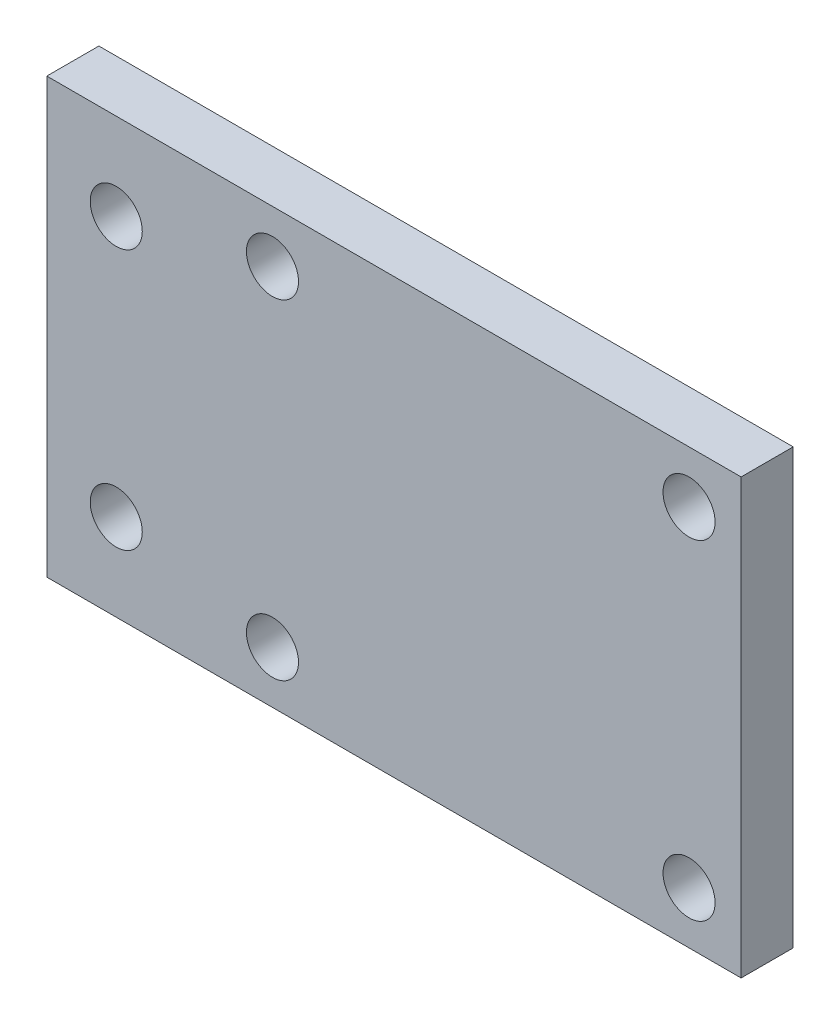
ISO-10303-21;
HEADER;
FILE_DESCRIPTION(('STEP AP214'),'2;1');
FILE_NAME('part.step','',(''),(''),'','','');
FILE_SCHEMA(('AUTOMOTIVE_DESIGN { 1 0 10303 214 1 1 1 1 }'));
ENDSEC;
DATA;
#1=APPLICATION_CONTEXT('core data for automotive mechanical design processes');
#2=APPLICATION_PROTOCOL_DEFINITION('international standard','automotive_design',2000,#1);
#3=PRODUCT_CONTEXT('',#1,'mechanical');
#4=PRODUCT('Part','Part','',(#3));
#5=PRODUCT_RELATED_PRODUCT_CATEGORY('part','',(#4));
#6=PRODUCT_DEFINITION_FORMATION('','',#4);
#7=PRODUCT_DEFINITION_CONTEXT('part definition',#1,'design');
#8=PRODUCT_DEFINITION('design','',#6,#7);
#9=PRODUCT_DEFINITION_SHAPE('','',#8);
#10=(LENGTH_UNIT() NAMED_UNIT(*) SI_UNIT(.MILLI.,.METRE.));
#11=(NAMED_UNIT(*) PLANE_ANGLE_UNIT() SI_UNIT($,.RADIAN.));
#12=(NAMED_UNIT(*) SI_UNIT($,.STERADIAN.) SOLID_ANGLE_UNIT());
#13=UNCERTAINTY_MEASURE_WITH_UNIT(LENGTH_MEASURE(1.E-05),#10,'distance_accuracy_value','');
#14=(GEOMETRIC_REPRESENTATION_CONTEXT(3) GLOBAL_UNCERTAINTY_ASSIGNED_CONTEXT((#13)) GLOBAL_UNIT_ASSIGNED_CONTEXT((#10,
#11,#12)) REPRESENTATION_CONTEXT('',''));
#15=CARTESIAN_POINT('',(0.,0.,0.));
#16=DIRECTION('',(0.,0.,1.));
#17=DIRECTION('',(1.,0.,0.));
#18=AXIS2_PLACEMENT_3D('',#15,#16,#17);
#19=CARTESIAN_POINT('',(0.,0.,3.));
#20=DIRECTION('',(0.,0.,-1.));
#21=DIRECTION('',(-1.,0.,0.));
#22=AXIS2_PLACEMENT_3D('',#19,#20,#21);
#23=PLANE('',#22);
#24=DIRECTION('',(0.,1.,0.));
#25=VECTOR('',#24,1.);
#26=CARTESIAN_POINT('',(20.,-12.5,3.));
#27=LINE('',#26,#25);
#28=CARTESIAN_POINT('',(20.,-12.5,3.));
#29=VERTEX_POINT('',#28);
#30=CARTESIAN_POINT('',(20.,12.5,3.));
#31=VERTEX_POINT('',#30);
#32=EDGE_CURVE('E91',#29,#31,#27,.T.);
#33=ORIENTED_EDGE('',*,*,#32,.T.);
#34=DIRECTION('',(-1.,0.,0.));
#35=VECTOR('',#34,1.);
#36=CARTESIAN_POINT('',(-20.,12.5,3.));
#37=LINE('',#36,#35);
#38=CARTESIAN_POINT('',(-20.,12.5,3.));
#39=VERTEX_POINT('',#38);
#40=EDGE_CURVE('E86',#31,#39,#37,.T.);
#41=ORIENTED_EDGE('',*,*,#40,.T.);
#42=DIRECTION('',(0.,-1.,0.));
#43=VECTOR('',#42,1.);
#44=CARTESIAN_POINT('',(-20.,-12.5,3.));
#45=LINE('',#44,#43);
#46=CARTESIAN_POINT('',(-20.,-12.5,3.));
#47=VERTEX_POINT('',#46);
#48=EDGE_CURVE('E89',#39,#47,#45,.T.);
#49=ORIENTED_EDGE('',*,*,#48,.T.);
#50=DIRECTION('',(1.,0.,0.));
#51=VECTOR('',#50,1.);
#52=CARTESIAN_POINT('',(-20.,-12.5,3.));
#53=LINE('',#52,#51);
#54=EDGE_CURVE('E56',#47,#29,#53,.T.);
#55=ORIENTED_EDGE('',*,*,#54,.T.);
#56=EDGE_LOOP('',(#33,#41,#49,#55));
#57=FACE_BOUND('',#56,.T.);
#58=CARTESIAN_POINT('',(-7.,9.5,3.));
#59=DIRECTION('',(0.,0.,1.));
#60=DIRECTION('',(1.,0.,0.));
#61=AXIS2_PLACEMENT_3D('',#58,#59,#60);
#62=CIRCLE('',#61,1.5);
#63=CARTESIAN_POINT('',(-5.5,9.5,3.));
#64=VERTEX_POINT('',#63);
#65=EDGE_CURVE('E108',#64,#64,#62,.T.);
#66=ORIENTED_EDGE('',*,*,#65,.F.);
#67=EDGE_LOOP('',(#66));
#68=FACE_BOUND('',#67,.T.);
#69=CARTESIAN_POINT('',(17.,9.5,3.));
#70=DIRECTION('',(0.,0.,1.));
#71=DIRECTION('',(1.,0.,0.));
#72=AXIS2_PLACEMENT_3D('',#69,#70,#71);
#73=CIRCLE('',#72,1.5);
#74=CARTESIAN_POINT('',(18.5,9.5,3.));
#75=VERTEX_POINT('',#74);
#76=EDGE_CURVE('E127',#75,#75,#73,.T.);
#77=ORIENTED_EDGE('',*,*,#76,.F.);
#78=EDGE_LOOP('',(#77));
#79=FACE_BOUND('',#78,.T.);
#80=CARTESIAN_POINT('',(-7.,-9.5,3.));
#81=DIRECTION('',(0.,0.,1.));
#82=DIRECTION('',(1.,0.,0.));
#83=AXIS2_PLACEMENT_3D('',#80,#81,#82);
#84=CIRCLE('',#83,1.5);
#85=CARTESIAN_POINT('',(-5.5,-9.5,3.));
#86=VERTEX_POINT('',#85);
#87=EDGE_CURVE('E133',#86,#86,#84,.T.);
#88=ORIENTED_EDGE('',*,*,#87,.F.);
#89=EDGE_LOOP('',(#88));
#90=FACE_BOUND('',#89,.T.);
#91=CARTESIAN_POINT('',(17.,-9.5,3.));
#92=DIRECTION('',(0.,0.,1.));
#93=DIRECTION('',(1.,0.,0.));
#94=AXIS2_PLACEMENT_3D('',#91,#92,#93);
#95=CIRCLE('',#94,1.5);
#96=CARTESIAN_POINT('',(18.5,-9.5,3.));
#97=VERTEX_POINT('',#96);
#98=EDGE_CURVE('E140',#97,#97,#95,.T.);
#99=ORIENTED_EDGE('',*,*,#98,.F.);
#100=EDGE_LOOP('',(#99));
#101=FACE_BOUND('',#100,.T.);
#102=CARTESIAN_POINT('',(-16.,7.5,3.));
#103=DIRECTION('',(0.,0.,1.));
#104=DIRECTION('',(1.,0.,0.));
#105=AXIS2_PLACEMENT_3D('',#102,#103,#104);
#106=CIRCLE('',#105,1.5);
#107=CARTESIAN_POINT('',(-14.5,7.5,3.));
#108=VERTEX_POINT('',#107);
#109=EDGE_CURVE('E147',#108,#108,#106,.T.);
#110=ORIENTED_EDGE('',*,*,#109,.F.);
#111=EDGE_LOOP('',(#110));
#112=FACE_BOUND('',#111,.T.);
#113=CARTESIAN_POINT('',(-16.,-7.5,3.));
#114=DIRECTION('',(0.,0.,1.));
#115=DIRECTION('',(1.,0.,0.));
#116=AXIS2_PLACEMENT_3D('',#113,#114,#115);
#117=CIRCLE('',#116,1.5);
#118=CARTESIAN_POINT('',(-14.5,-7.5,3.));
#119=VERTEX_POINT('',#118);
#120=EDGE_CURVE('E153',#119,#119,#117,.T.);
#121=ORIENTED_EDGE('',*,*,#120,.F.);
#122=EDGE_LOOP('',(#121));
#123=FACE_BOUND('',#122,.T.);
#124=ADVANCED_FACE('F39',(#57,#68,#79,#90,#101,#112,#123),#23,.F.);
#125=CARTESIAN_POINT('',(0.,0.,0.));
#126=DIRECTION('',(0.,0.,-1.));
#127=DIRECTION('',(-1.,0.,0.));
#128=AXIS2_PLACEMENT_3D('',#125,#126,#127);
#129=PLANE('',#128);
#130=CARTESIAN_POINT('',(-16.,7.5,0.));
#131=DIRECTION('',(0.,0.,1.));
#132=DIRECTION('',(1.,0.,0.));
#133=AXIS2_PLACEMENT_3D('',#130,#131,#132);
#134=CIRCLE('',#133,1.5);
#135=CARTESIAN_POINT('',(-14.5,7.5,0.));
#136=VERTEX_POINT('',#135);
#137=EDGE_CURVE('E150',#136,#136,#134,.T.);
#138=ORIENTED_EDGE('',*,*,#137,.T.);
#139=EDGE_LOOP('',(#138));
#140=FACE_BOUND('',#139,.T.);
#141=CARTESIAN_POINT('',(-7.,-9.5,0.));
#142=DIRECTION('',(0.,0.,1.));
#143=DIRECTION('',(1.,0.,0.));
#144=AXIS2_PLACEMENT_3D('',#141,#142,#143);
#145=CIRCLE('',#144,1.5);
#146=CARTESIAN_POINT('',(-5.5,-9.5,0.));
#147=VERTEX_POINT('',#146);
#148=EDGE_CURVE('E136',#147,#147,#145,.T.);
#149=ORIENTED_EDGE('',*,*,#148,.T.);
#150=EDGE_LOOP('',(#149));
#151=FACE_BOUND('',#150,.T.);
#152=CARTESIAN_POINT('',(-7.,9.5,0.));
#153=DIRECTION('',(0.,0.,1.));
#154=DIRECTION('',(1.,0.,0.));
#155=AXIS2_PLACEMENT_3D('',#152,#153,#154);
#156=CIRCLE('',#155,1.5);
#157=CARTESIAN_POINT('',(-5.5,9.5,0.));
#158=VERTEX_POINT('',#157);
#159=EDGE_CURVE('E124',#158,#158,#156,.T.);
#160=ORIENTED_EDGE('',*,*,#159,.T.);
#161=EDGE_LOOP('',(#160));
#162=FACE_BOUND('',#161,.T.);
#163=DIRECTION('',(0.,1.,0.));
#164=VECTOR('',#163,1.);
#165=CARTESIAN_POINT('',(20.,-12.5,0.));
#166=LINE('',#165,#164);
#167=CARTESIAN_POINT('',(20.,-12.5,0.));
#168=VERTEX_POINT('',#167);
#169=CARTESIAN_POINT('',(20.,12.5,0.));
#170=VERTEX_POINT('',#169);
#171=EDGE_CURVE('E104',#168,#170,#166,.T.);
#172=ORIENTED_EDGE('',*,*,#171,.F.);
#173=DIRECTION('',(1.,0.,0.));
#174=VECTOR('',#173,1.);
#175=CARTESIAN_POINT('',(-20.,-12.5,0.));
#176=LINE('',#175,#174);
#177=CARTESIAN_POINT('',(-20.,-12.5,0.));
#178=VERTEX_POINT('',#177);
#179=EDGE_CURVE('E79',#178,#168,#176,.T.);
#180=ORIENTED_EDGE('',*,*,#179,.F.);
#181=DIRECTION('',(0.,-1.,0.));
#182=VECTOR('',#181,1.);
#183=CARTESIAN_POINT('',(-20.,-12.5,0.));
#184=LINE('',#183,#182);
#185=CARTESIAN_POINT('',(-20.,12.5,0.));
#186=VERTEX_POINT('',#185);
#187=EDGE_CURVE('E73',#186,#178,#184,.T.);
#188=ORIENTED_EDGE('',*,*,#187,.F.);
#189=DIRECTION('',(-1.,0.,0.));
#190=VECTOR('',#189,1.);
#191=CARTESIAN_POINT('',(-20.,12.5,0.));
#192=LINE('',#191,#190);
#193=EDGE_CURVE('E95',#170,#186,#192,.T.);
#194=ORIENTED_EDGE('',*,*,#193,.F.);
#195=EDGE_LOOP('',(#172,#180,#188,#194));
#196=FACE_BOUND('',#195,.T.);
#197=CARTESIAN_POINT('',(17.,9.5,0.));
#198=DIRECTION('',(0.,0.,1.));
#199=DIRECTION('',(1.,0.,0.));
#200=AXIS2_PLACEMENT_3D('',#197,#198,#199);
#201=CIRCLE('',#200,1.5);
#202=CARTESIAN_POINT('',(18.5,9.5,0.));
#203=VERTEX_POINT('',#202);
#204=EDGE_CURVE('E130',#203,#203,#201,.T.);
#205=ORIENTED_EDGE('',*,*,#204,.T.);
#206=EDGE_LOOP('',(#205));
#207=FACE_BOUND('',#206,.T.);
#208=CARTESIAN_POINT('',(17.,-9.5,0.));
#209=DIRECTION('',(0.,0.,1.));
#210=DIRECTION('',(1.,0.,0.));
#211=AXIS2_PLACEMENT_3D('',#208,#209,#210);
#212=CIRCLE('',#211,1.5);
#213=CARTESIAN_POINT('',(18.5,-9.5,0.));
#214=VERTEX_POINT('',#213);
#215=EDGE_CURVE('E143',#214,#214,#212,.T.);
#216=ORIENTED_EDGE('',*,*,#215,.T.);
#217=EDGE_LOOP('',(#216));
#218=FACE_BOUND('',#217,.T.);
#219=CARTESIAN_POINT('',(-16.,-7.5,0.));
#220=DIRECTION('',(0.,0.,1.));
#221=DIRECTION('',(1.,0.,0.));
#222=AXIS2_PLACEMENT_3D('',#219,#220,#221);
#223=CIRCLE('',#222,1.5);
#224=CARTESIAN_POINT('',(-14.5,-7.5,0.));
#225=VERTEX_POINT('',#224);
#226=EDGE_CURVE('E156',#225,#225,#223,.T.);
#227=ORIENTED_EDGE('',*,*,#226,.T.);
#228=EDGE_LOOP('',(#227));
#229=FACE_BOUND('',#228,.T.);
#230=ADVANCED_FACE('F120',(#140,#151,#162,#196,#207,#218,#229),#129,.T.);
#231=CARTESIAN_POINT('',(20.,-12.5,3.));
#232=DIRECTION('',(-1.,0.,0.));
#233=DIRECTION('',(0.,0.,1.));
#234=AXIS2_PLACEMENT_3D('',#231,#232,#233);
#235=PLANE('',#234);
#236=ORIENTED_EDGE('',*,*,#171,.T.);
#237=DIRECTION('',(0.,0.,-1.));
#238=VECTOR('',#237,1.);
#239=CARTESIAN_POINT('',(20.,12.5,3.));
#240=LINE('',#239,#238);
#241=EDGE_CURVE('E11',#31,#170,#240,.T.);
#242=ORIENTED_EDGE('',*,*,#241,.F.);
#243=ORIENTED_EDGE('',*,*,#32,.F.);
#244=DIRECTION('',(0.,0.,-1.));
#245=VECTOR('',#244,1.);
#246=CARTESIAN_POINT('',(20.,-12.5,3.));
#247=LINE('',#246,#245);
#248=EDGE_CURVE('E100',#29,#168,#247,.T.);
#249=ORIENTED_EDGE('',*,*,#248,.T.);
#250=EDGE_LOOP('',(#236,#242,#243,#249));
#251=FACE_BOUND('',#250,.T.);
#252=ADVANCED_FACE('F41',(#251),#235,.F.);
#253=CARTESIAN_POINT('',(-20.,12.5,3.));
#254=DIRECTION('',(0.,-1.,0.));
#255=DIRECTION('',(0.,0.,-1.));
#256=AXIS2_PLACEMENT_3D('',#253,#254,#255);
#257=PLANE('',#256);
#258=ORIENTED_EDGE('',*,*,#193,.T.);
#259=DIRECTION('',(0.,0.,-1.));
#260=VECTOR('',#259,1.);
#261=CARTESIAN_POINT('',(-20.,12.5,3.));
#262=LINE('',#261,#260);
#263=EDGE_CURVE('E48',#39,#186,#262,.T.);
#264=ORIENTED_EDGE('',*,*,#263,.F.);
#265=ORIENTED_EDGE('',*,*,#40,.F.);
#266=ORIENTED_EDGE('',*,*,#241,.T.);
#267=EDGE_LOOP('',(#258,#264,#265,#266));
#268=FACE_BOUND('',#267,.T.);
#269=ADVANCED_FACE('F94',(#268),#257,.F.);
#270=CARTESIAN_POINT('',(-20.,-12.5,3.));
#271=DIRECTION('',(1.,0.,0.));
#272=DIRECTION('',(0.,0.,-1.));
#273=AXIS2_PLACEMENT_3D('',#270,#271,#272);
#274=PLANE('',#273);
#275=ORIENTED_EDGE('',*,*,#187,.T.);
#276=DIRECTION('',(0.,0.,-1.));
#277=VECTOR('',#276,1.);
#278=CARTESIAN_POINT('',(-20.,-12.5,3.));
#279=LINE('',#278,#277);
#280=EDGE_CURVE('E97',#47,#178,#279,.T.);
#281=ORIENTED_EDGE('',*,*,#280,.F.);
#282=ORIENTED_EDGE('',*,*,#48,.F.);
#283=ORIENTED_EDGE('',*,*,#263,.T.);
#284=EDGE_LOOP('',(#275,#281,#282,#283));
#285=FACE_BOUND('',#284,.T.);
#286=ADVANCED_FACE('F98',(#285),#274,.F.);
#287=CARTESIAN_POINT('',(-20.,-12.5,3.));
#288=DIRECTION('',(0.,1.,0.));
#289=DIRECTION('',(0.,0.,1.));
#290=AXIS2_PLACEMENT_3D('',#287,#288,#289);
#291=PLANE('',#290);
#292=ORIENTED_EDGE('',*,*,#179,.T.);
#293=ORIENTED_EDGE('',*,*,#248,.F.);
#294=ORIENTED_EDGE('',*,*,#54,.F.);
#295=ORIENTED_EDGE('',*,*,#280,.T.);
#296=EDGE_LOOP('',(#292,#293,#294,#295));
#297=FACE_BOUND('',#296,.T.);
#298=ADVANCED_FACE('F117',(#297),#291,.F.);
#299=CARTESIAN_POINT('',(-7.,9.5,3.));
#300=DIRECTION('',(0.,0.,-1.));
#301=DIRECTION('',(-1.,0.,0.));
#302=AXIS2_PLACEMENT_3D('',#299,#300,#301);
#303=CYLINDRICAL_SURFACE('',#302,1.5);
#304=ORIENTED_EDGE('',*,*,#65,.T.);
#305=EDGE_LOOP('',(#304));
#306=FACE_BOUND('',#305,.T.);
#307=ORIENTED_EDGE('',*,*,#159,.F.);
#308=EDGE_LOOP('',(#307));
#309=FACE_BOUND('',#308,.T.);
#310=ADVANCED_FACE('F174',(#306,#309),#303,.F.);
#311=CARTESIAN_POINT('',(17.,9.5,3.));
#312=DIRECTION('',(0.,0.,-1.));
#313=DIRECTION('',(-1.,0.,0.));
#314=AXIS2_PLACEMENT_3D('',#311,#312,#313);
#315=CYLINDRICAL_SURFACE('',#314,1.5);
#316=ORIENTED_EDGE('',*,*,#76,.T.);
#317=EDGE_LOOP('',(#316));
#318=FACE_BOUND('',#317,.T.);
#319=ORIENTED_EDGE('',*,*,#204,.F.);
#320=EDGE_LOOP('',(#319));
#321=FACE_BOUND('',#320,.T.);
#322=ADVANCED_FACE('F198',(#318,#321),#315,.F.);
#323=CARTESIAN_POINT('',(-7.,-9.5,3.));
#324=DIRECTION('',(0.,0.,-1.));
#325=DIRECTION('',(-1.,0.,0.));
#326=AXIS2_PLACEMENT_3D('',#323,#324,#325);
#327=CYLINDRICAL_SURFACE('',#326,1.5);
#328=ORIENTED_EDGE('',*,*,#87,.T.);
#329=EDGE_LOOP('',(#328));
#330=FACE_BOUND('',#329,.T.);
#331=ORIENTED_EDGE('',*,*,#148,.F.);
#332=EDGE_LOOP('',(#331));
#333=FACE_BOUND('',#332,.T.);
#334=ADVANCED_FACE('F240',(#330,#333),#327,.F.);
#335=CARTESIAN_POINT('',(17.,-9.5,3.));
#336=DIRECTION('',(0.,0.,-1.));
#337=DIRECTION('',(-1.,0.,0.));
#338=AXIS2_PLACEMENT_3D('',#335,#336,#337);
#339=CYLINDRICAL_SURFACE('',#338,1.5);
#340=ORIENTED_EDGE('',*,*,#98,.T.);
#341=EDGE_LOOP('',(#340));
#342=FACE_BOUND('',#341,.T.);
#343=ORIENTED_EDGE('',*,*,#215,.F.);
#344=EDGE_LOOP('',(#343));
#345=FACE_BOUND('',#344,.T.);
#346=ADVANCED_FACE('F207',(#342,#345),#339,.F.);
#347=CARTESIAN_POINT('',(-16.,7.5,3.));
#348=DIRECTION('',(0.,0.,-1.));
#349=DIRECTION('',(-1.,0.,0.));
#350=AXIS2_PLACEMENT_3D('',#347,#348,#349);
#351=CYLINDRICAL_SURFACE('',#350,1.5);
#352=ORIENTED_EDGE('',*,*,#109,.T.);
#353=EDGE_LOOP('',(#352));
#354=FACE_BOUND('',#353,.T.);
#355=ORIENTED_EDGE('',*,*,#137,.F.);
#356=EDGE_LOOP('',(#355));
#357=FACE_BOUND('',#356,.T.);
#358=ADVANCED_FACE('F203',(#354,#357),#351,.F.);
#359=CARTESIAN_POINT('',(-16.,-7.5,3.));
#360=DIRECTION('',(0.,0.,-1.));
#361=DIRECTION('',(-1.,0.,0.));
#362=AXIS2_PLACEMENT_3D('',#359,#360,#361);
#363=CYLINDRICAL_SURFACE('',#362,1.5);
#364=ORIENTED_EDGE('',*,*,#120,.T.);
#365=EDGE_LOOP('',(#364));
#366=FACE_BOUND('',#365,.T.);
#367=ORIENTED_EDGE('',*,*,#226,.F.);
#368=EDGE_LOOP('',(#367));
#369=FACE_BOUND('',#368,.T.);
#370=ADVANCED_FACE('F163',(#366,#369),#363,.F.);
#371=CLOSED_SHELL('',(#124,#230,#252,#269,#286,#298,#310,#322,#334,#346,#358,#370));
#372=MANIFOLD_SOLID_BREP('B2',#371);
#373=ADVANCED_BREP_SHAPE_REPRESENTATION('',(#18,#372),#14);
#374=SHAPE_DEFINITION_REPRESENTATION(#9,#373);
ENDSEC;
END-ISO-10303-21;
